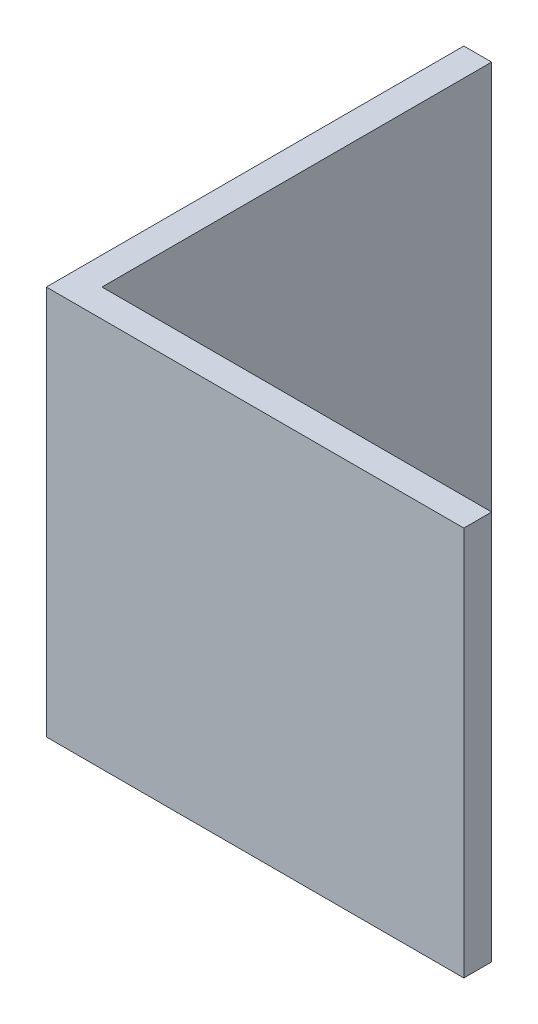
ISO-10303-21;
HEADER;
FILE_DESCRIPTION(('STEP AP214'),'2;1');
FILE_NAME('part.step','',(''),(''),'','','');
FILE_SCHEMA(('AUTOMOTIVE_DESIGN { 1 0 10303 214 1 1 1 1 }'));
ENDSEC;
DATA;
#1=APPLICATION_CONTEXT('core data for automotive mechanical design processes');
#2=APPLICATION_PROTOCOL_DEFINITION('international standard','automotive_design',2000,#1);
#3=PRODUCT_CONTEXT('',#1,'mechanical');
#4=PRODUCT('Part','Part','',(#3));
#5=PRODUCT_RELATED_PRODUCT_CATEGORY('part','',(#4));
#6=PRODUCT_DEFINITION_FORMATION('','',#4);
#7=PRODUCT_DEFINITION_CONTEXT('part definition',#1,'design');
#8=PRODUCT_DEFINITION('design','',#6,#7);
#9=PRODUCT_DEFINITION_SHAPE('','',#8);
#10=(LENGTH_UNIT() NAMED_UNIT(*) SI_UNIT(.MILLI.,.METRE.));
#11=(NAMED_UNIT(*) PLANE_ANGLE_UNIT() SI_UNIT($,.RADIAN.));
#12=(NAMED_UNIT(*) SI_UNIT($,.STERADIAN.) SOLID_ANGLE_UNIT());
#13=UNCERTAINTY_MEASURE_WITH_UNIT(LENGTH_MEASURE(1.E-05),#10,'distance_accuracy_value','');
#14=(GEOMETRIC_REPRESENTATION_CONTEXT(3) GLOBAL_UNCERTAINTY_ASSIGNED_CONTEXT((#13)) GLOBAL_UNIT_ASSIGNED_CONTEXT((#10,
#11,#12)) REPRESENTATION_CONTEXT('',''));
#15=CARTESIAN_POINT('',(0.,0.,0.));
#16=DIRECTION('',(0.,0.,1.));
#17=DIRECTION('',(1.,0.,0.));
#18=AXIS2_PLACEMENT_3D('',#15,#16,#17);
#19=CARTESIAN_POINT('',(15.,14.,0.));
#20=DIRECTION('',(0.,0.,-1.));
#21=DIRECTION('',(-1.,0.,0.));
#22=AXIS2_PLACEMENT_3D('',#19,#20,#21);
#23=PLANE('',#22);
#24=DIRECTION('',(1.,0.,0.));
#25=VECTOR('',#24,1.);
#26=CARTESIAN_POINT('',(15.,0.,0.));
#27=LINE('',#26,#25);
#28=CARTESIAN_POINT('',(0.,0.,0.));
#29=VERTEX_POINT('',#28);
#30=CARTESIAN_POINT('',(15.,0.,0.));
#31=VERTEX_POINT('',#30);
#32=EDGE_CURVE('E119',#29,#31,#27,.T.);
#33=ORIENTED_EDGE('',*,*,#32,.T.);
#34=DIRECTION('',(0.,-1.,0.));
#35=VECTOR('',#34,1.);
#36=CARTESIAN_POINT('',(15.,14.,0.));
#37=LINE('',#36,#35);
#38=CARTESIAN_POINT('',(15.,14.,0.));
#39=VERTEX_POINT('',#38);
#40=EDGE_CURVE('E11',#39,#31,#37,.T.);
#41=ORIENTED_EDGE('',*,*,#40,.F.);
#42=DIRECTION('',(1.,0.,0.));
#43=VECTOR('',#42,1.);
#44=CARTESIAN_POINT('',(15.,14.,0.));
#45=LINE('',#44,#43);
#46=CARTESIAN_POINT('',(0.,14.,0.));
#47=VERTEX_POINT('',#46);
#48=EDGE_CURVE('E129',#47,#39,#45,.T.);
#49=ORIENTED_EDGE('',*,*,#48,.F.);
#50=DIRECTION('',(0.,-1.,0.));
#51=VECTOR('',#50,1.);
#52=CARTESIAN_POINT('',(0.,14.,0.));
#53=LINE('',#52,#51);
#54=EDGE_CURVE('E115',#47,#29,#53,.T.);
#55=ORIENTED_EDGE('',*,*,#54,.T.);
#56=EDGE_LOOP('',(#33,#41,#49,#55));
#57=FACE_BOUND('',#56,.T.);
#58=ADVANCED_FACE('F35',(#57),#23,.F.);
#59=CARTESIAN_POINT('',(15.,14.,-0.999999999999998));
#60=DIRECTION('',(-1.,0.,0.));
#61=DIRECTION('',(0.,0.,1.));
#62=AXIS2_PLACEMENT_3D('',#59,#60,#61);
#63=PLANE('',#62);
#64=DIRECTION('',(0.,0.,-1.));
#65=VECTOR('',#64,1.);
#66=CARTESIAN_POINT('',(15.,0.,-0.999999999999998));
#67=LINE('',#66,#65);
#68=CARTESIAN_POINT('',(15.,0.,-0.999999999999998));
#69=VERTEX_POINT('',#68);
#70=EDGE_CURVE('E122',#31,#69,#67,.T.);
#71=ORIENTED_EDGE('',*,*,#70,.T.);
#72=DIRECTION('',(0.,-1.,0.));
#73=VECTOR('',#72,1.);
#74=CARTESIAN_POINT('',(15.,14.,-0.999999999999998));
#75=LINE('',#74,#73);
#76=CARTESIAN_POINT('',(15.,14.,-0.999999999999998));
#77=VERTEX_POINT('',#76);
#78=EDGE_CURVE('E43',#77,#69,#75,.T.);
#79=ORIENTED_EDGE('',*,*,#78,.F.);
#80=DIRECTION('',(0.,0.,-1.));
#81=VECTOR('',#80,1.);
#82=CARTESIAN_POINT('',(15.,14.,-0.999999999999998));
#83=LINE('',#82,#81);
#84=EDGE_CURVE('E88',#39,#77,#83,.T.);
#85=ORIENTED_EDGE('',*,*,#84,.F.);
#86=ORIENTED_EDGE('',*,*,#40,.T.);
#87=EDGE_LOOP('',(#71,#79,#85,#86));
#88=FACE_BOUND('',#87,.T.);
#89=ADVANCED_FACE('F153',(#88),#63,.F.);
#90=CARTESIAN_POINT('',(1.,14.,-0.999999999999997));
#91=DIRECTION('',(0.,0.,1.));
#92=DIRECTION('',(1.,0.,0.));
#93=AXIS2_PLACEMENT_3D('',#90,#91,#92);
#94=PLANE('',#93);
#95=DIRECTION('',(-1.,0.,0.));
#96=VECTOR('',#95,1.);
#97=CARTESIAN_POINT('',(1.,0.,-0.999999999999997));
#98=LINE('',#97,#96);
#99=CARTESIAN_POINT('',(1.,0.,-0.999999999999997));
#100=VERTEX_POINT('',#99);
#101=EDGE_CURVE('E124',#69,#100,#98,.T.);
#102=ORIENTED_EDGE('',*,*,#101,.T.);
#103=DIRECTION('',(0.,-1.,0.));
#104=VECTOR('',#103,1.);
#105=CARTESIAN_POINT('',(1.,14.,-0.999999999999997));
#106=LINE('',#105,#104);
#107=CARTESIAN_POINT('',(1.,14.,-0.999999999999997));
#108=VERTEX_POINT('',#107);
#109=EDGE_CURVE('E110',#108,#100,#106,.T.);
#110=ORIENTED_EDGE('',*,*,#109,.F.);
#111=DIRECTION('',(-1.,0.,0.));
#112=VECTOR('',#111,1.);
#113=CARTESIAN_POINT('',(1.,14.,-0.999999999999997));
#114=LINE('',#113,#112);
#115=EDGE_CURVE('E101',#77,#108,#114,.T.);
#116=ORIENTED_EDGE('',*,*,#115,.F.);
#117=ORIENTED_EDGE('',*,*,#78,.T.);
#118=EDGE_LOOP('',(#102,#110,#116,#117));
#119=FACE_BOUND('',#118,.T.);
#120=ADVANCED_FACE('F135',(#119),#94,.F.);
#121=CARTESIAN_POINT('',(0.999999999999998,14.,-15.));
#122=DIRECTION('',(-1.,0.,0.));
#123=DIRECTION('',(0.,0.,1.));
#124=AXIS2_PLACEMENT_3D('',#121,#122,#123);
#125=PLANE('',#124);
#126=DIRECTION('',(0.,0.,-1.));
#127=VECTOR('',#126,1.);
#128=CARTESIAN_POINT('',(0.999999999999998,0.,-15.));
#129=LINE('',#128,#127);
#130=CARTESIAN_POINT('',(0.999999999999998,0.,-15.));
#131=VERTEX_POINT('',#130);
#132=EDGE_CURVE('E109',#100,#131,#129,.T.);
#133=ORIENTED_EDGE('',*,*,#132,.T.);
#134=DIRECTION('',(0.,-1.,0.));
#135=VECTOR('',#134,1.);
#136=CARTESIAN_POINT('',(0.999999999999998,14.,-15.));
#137=LINE('',#136,#135);
#138=CARTESIAN_POINT('',(0.999999999999998,14.,-15.));
#139=VERTEX_POINT('',#138);
#140=EDGE_CURVE('E106',#139,#131,#137,.T.);
#141=ORIENTED_EDGE('',*,*,#140,.F.);
#142=DIRECTION('',(0.,0.,-1.));
#143=VECTOR('',#142,1.);
#144=CARTESIAN_POINT('',(0.999999999999998,14.,-15.));
#145=LINE('',#144,#143);
#146=EDGE_CURVE('E95',#108,#139,#145,.T.);
#147=ORIENTED_EDGE('',*,*,#146,.F.);
#148=ORIENTED_EDGE('',*,*,#109,.T.);
#149=EDGE_LOOP('',(#133,#141,#147,#148));
#150=FACE_BOUND('',#149,.T.);
#151=ADVANCED_FACE('F107',(#150),#125,.F.);
#152=CARTESIAN_POINT('',(0.,14.,-15.));
#153=DIRECTION('',(0.,0.,1.));
#154=DIRECTION('',(1.,0.,0.));
#155=AXIS2_PLACEMENT_3D('',#152,#153,#154);
#156=PLANE('',#155);
#157=DIRECTION('',(-1.,0.,0.));
#158=VECTOR('',#157,1.);
#159=CARTESIAN_POINT('',(0.,0.,-15.));
#160=LINE('',#159,#158);
#161=CARTESIAN_POINT('',(0.,0.,-15.));
#162=VERTEX_POINT('',#161);
#163=EDGE_CURVE('E74',#131,#162,#160,.T.);
#164=ORIENTED_EDGE('',*,*,#163,.T.);
#165=DIRECTION('',(0.,-1.,0.));
#166=VECTOR('',#165,1.);
#167=CARTESIAN_POINT('',(0.,14.,-15.));
#168=LINE('',#167,#166);
#169=CARTESIAN_POINT('',(0.,14.,-15.));
#170=VERTEX_POINT('',#169);
#171=EDGE_CURVE('E111',#170,#162,#168,.T.);
#172=ORIENTED_EDGE('',*,*,#171,.F.);
#173=DIRECTION('',(-1.,0.,0.));
#174=VECTOR('',#173,1.);
#175=CARTESIAN_POINT('',(0.,14.,-15.));
#176=LINE('',#175,#174);
#177=EDGE_CURVE('E99',#139,#170,#176,.T.);
#178=ORIENTED_EDGE('',*,*,#177,.F.);
#179=ORIENTED_EDGE('',*,*,#140,.T.);
#180=EDGE_LOOP('',(#164,#172,#178,#179));
#181=FACE_BOUND('',#180,.T.);
#182=ADVANCED_FACE('F113',(#181),#156,.F.);
#183=CARTESIAN_POINT('',(0.,14.,0.));
#184=DIRECTION('',(1.,0.,0.));
#185=DIRECTION('',(0.,0.,-1.));
#186=AXIS2_PLACEMENT_3D('',#183,#184,#185);
#187=PLANE('',#186);
#188=DIRECTION('',(0.,0.,1.));
#189=VECTOR('',#188,1.);
#190=CARTESIAN_POINT('',(0.,0.,0.));
#191=LINE('',#190,#189);
#192=EDGE_CURVE('E80',#162,#29,#191,.T.);
#193=ORIENTED_EDGE('',*,*,#192,.T.);
#194=ORIENTED_EDGE('',*,*,#54,.F.);
#195=DIRECTION('',(0.,0.,1.));
#196=VECTOR('',#195,1.);
#197=CARTESIAN_POINT('',(0.,14.,0.));
#198=LINE('',#197,#196);
#199=EDGE_CURVE('E51',#170,#47,#198,.T.);
#200=ORIENTED_EDGE('',*,*,#199,.F.);
#201=ORIENTED_EDGE('',*,*,#171,.T.);
#202=EDGE_LOOP('',(#193,#194,#200,#201));
#203=FACE_BOUND('',#202,.T.);
#204=ADVANCED_FACE('F142',(#203),#187,.F.);
#205=CARTESIAN_POINT('',(0.,14.,0.));
#206=DIRECTION('',(0.,-1.,0.));
#207=DIRECTION('',(0.,0.,-1.));
#208=AXIS2_PLACEMENT_3D('',#205,#206,#207);
#209=PLANE('',#208);
#210=ORIENTED_EDGE('',*,*,#48,.T.);
#211=ORIENTED_EDGE('',*,*,#84,.T.);
#212=ORIENTED_EDGE('',*,*,#115,.T.);
#213=ORIENTED_EDGE('',*,*,#146,.T.);
#214=ORIENTED_EDGE('',*,*,#177,.T.);
#215=ORIENTED_EDGE('',*,*,#199,.T.);
#216=EDGE_LOOP('',(#210,#211,#212,#213,#214,#215));
#217=FACE_BOUND('',#216,.T.);
#218=ADVANCED_FACE('F97',(#217),#209,.F.);
#219=CARTESIAN_POINT('',(0.,0.,0.));
#220=DIRECTION('',(0.,-1.,0.));
#221=DIRECTION('',(0.,0.,-1.));
#222=AXIS2_PLACEMENT_3D('',#219,#220,#221);
#223=PLANE('',#222);
#224=ORIENTED_EDGE('',*,*,#32,.F.);
#225=ORIENTED_EDGE('',*,*,#192,.F.);
#226=ORIENTED_EDGE('',*,*,#163,.F.);
#227=ORIENTED_EDGE('',*,*,#132,.F.);
#228=ORIENTED_EDGE('',*,*,#101,.F.);
#229=ORIENTED_EDGE('',*,*,#70,.F.);
#230=EDGE_LOOP('',(#224,#225,#226,#227,#228,#229));
#231=FACE_BOUND('',#230,.T.);
#232=ADVANCED_FACE('F138',(#231),#223,.T.);
#233=CLOSED_SHELL('',(#58,#89,#120,#151,#182,#204,#218,#232));
#234=MANIFOLD_SOLID_BREP('B2',#233);
#235=ADVANCED_BREP_SHAPE_REPRESENTATION('',(#18,#234),#14);
#236=SHAPE_DEFINITION_REPRESENTATION(#9,#235);
ENDSEC;
END-ISO-10303-21;
